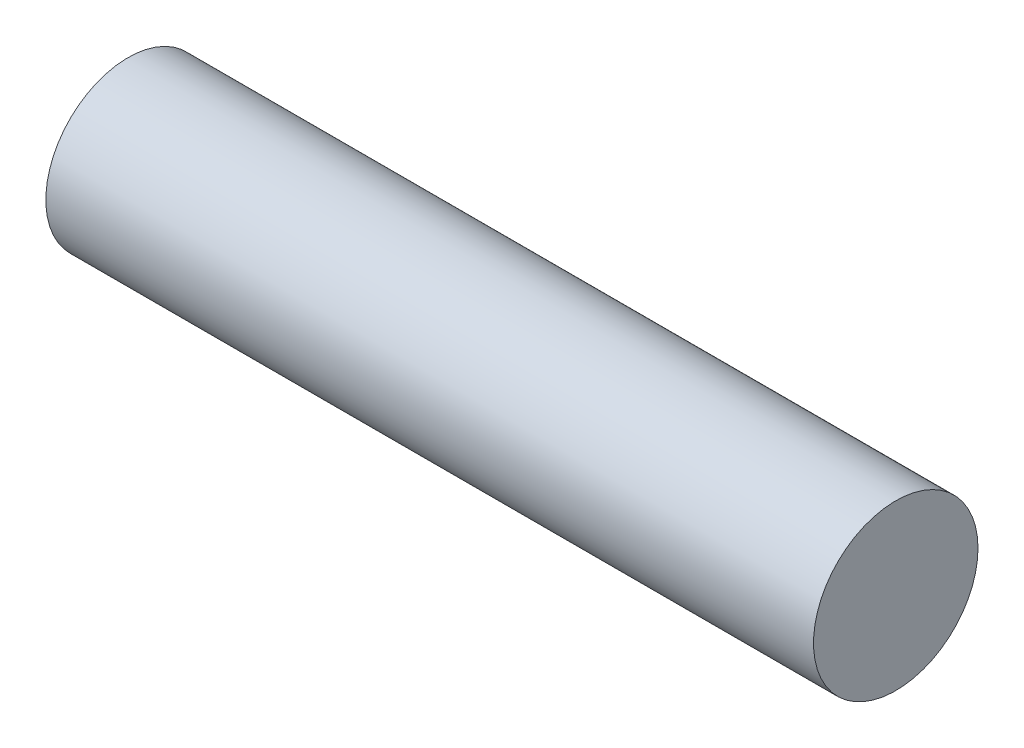
ISO-10303-21;
HEADER;
FILE_DESCRIPTION(('STEP AP214'),'2;1');
FILE_NAME('part.step','',(''),(''),'','','');
FILE_SCHEMA(('AUTOMOTIVE_DESIGN { 1 0 10303 214 1 1 1 1 }'));
ENDSEC;
DATA;
#1=APPLICATION_CONTEXT('core data for automotive mechanical design processes');
#2=APPLICATION_PROTOCOL_DEFINITION('international standard','automotive_design',2000,#1);
#3=PRODUCT_CONTEXT('',#1,'mechanical');
#4=PRODUCT('Part','Part','',(#3));
#5=PRODUCT_RELATED_PRODUCT_CATEGORY('part','',(#4));
#6=PRODUCT_DEFINITION_FORMATION('','',#4);
#7=PRODUCT_DEFINITION_CONTEXT('part definition',#1,'design');
#8=PRODUCT_DEFINITION('design','',#6,#7);
#9=PRODUCT_DEFINITION_SHAPE('','',#8);
#10=(LENGTH_UNIT() NAMED_UNIT(*) SI_UNIT(.MILLI.,.METRE.));
#11=(NAMED_UNIT(*) PLANE_ANGLE_UNIT() SI_UNIT($,.RADIAN.));
#12=(NAMED_UNIT(*) SI_UNIT($,.STERADIAN.) SOLID_ANGLE_UNIT());
#13=UNCERTAINTY_MEASURE_WITH_UNIT(LENGTH_MEASURE(1.E-05),#10,'distance_accuracy_value','');
#14=(GEOMETRIC_REPRESENTATION_CONTEXT(3) GLOBAL_UNCERTAINTY_ASSIGNED_CONTEXT((#13)) GLOBAL_UNIT_ASSIGNED_CONTEXT((#10,
#11,#12)) REPRESENTATION_CONTEXT('',''));
#15=CARTESIAN_POINT('',(0.,0.,0.));
#16=DIRECTION('',(0.,0.,1.));
#17=DIRECTION('',(1.,0.,0.));
#18=AXIS2_PLACEMENT_3D('',#15,#16,#17);
#19=CARTESIAN_POINT('',(35.,0.,0.));
#20=DIRECTION('',(-1.,0.,0.));
#21=DIRECTION('',(0.,0.,1.));
#22=AXIS2_PLACEMENT_3D('',#19,#20,#21);
#23=CYLINDRICAL_SURFACE('',#22,7.5);
#24=CARTESIAN_POINT('',(35.,0.,0.));
#25=DIRECTION('',(1.,0.,0.));
#26=DIRECTION('',(0.,0.,-1.));
#27=AXIS2_PLACEMENT_3D('',#24,#25,#26);
#28=CIRCLE('',#27,7.5);
#29=CARTESIAN_POINT('',(35.,0.,-7.5));
#30=VERTEX_POINT('',#29);
#31=EDGE_CURVE('E10',#30,#30,#28,.T.);
#32=ORIENTED_EDGE('',*,*,#31,.F.);
#33=EDGE_LOOP('',(#32));
#34=FACE_BOUND('',#33,.T.);
#35=CARTESIAN_POINT('',(-35.,0.,0.));
#36=DIRECTION('',(1.,0.,0.));
#37=DIRECTION('',(0.,0.,-1.));
#38=AXIS2_PLACEMENT_3D('',#35,#36,#37);
#39=CIRCLE('',#38,7.5);
#40=CARTESIAN_POINT('',(-35.,0.,-7.5));
#41=VERTEX_POINT('',#40);
#42=EDGE_CURVE('E40',#41,#41,#39,.T.);
#43=ORIENTED_EDGE('',*,*,#42,.T.);
#44=EDGE_LOOP('',(#43));
#45=FACE_BOUND('',#44,.T.);
#46=ADVANCED_FACE('F37',(#34,#45),#23,.T.);
#47=CARTESIAN_POINT('',(35.,0.,0.));
#48=DIRECTION('',(1.,0.,0.));
#49=DIRECTION('',(0.,0.,-1.));
#50=AXIS2_PLACEMENT_3D('',#47,#48,#49);
#51=PLANE('',#50);
#52=ORIENTED_EDGE('',*,*,#31,.T.);
#53=EDGE_LOOP('',(#52));
#54=FACE_BOUND('',#53,.T.);
#55=ADVANCED_FACE('F54',(#54),#51,.T.);
#56=CARTESIAN_POINT('',(-35.,0.,0.));
#57=DIRECTION('',(1.,0.,0.));
#58=DIRECTION('',(0.,0.,-1.));
#59=AXIS2_PLACEMENT_3D('',#56,#57,#58);
#60=PLANE('',#59);
#61=ORIENTED_EDGE('',*,*,#42,.F.);
#62=EDGE_LOOP('',(#61));
#63=FACE_BOUND('',#62,.T.);
#64=ADVANCED_FACE('F52',(#63),#60,.F.);
#65=CLOSED_SHELL('',(#46,#55,#64));
#66=MANIFOLD_SOLID_BREP('B2',#65);
#67=ADVANCED_BREP_SHAPE_REPRESENTATION('',(#18,#66),#14);
#68=SHAPE_DEFINITION_REPRESENTATION(#9,#67);
ENDSEC;
END-ISO-10303-21;
